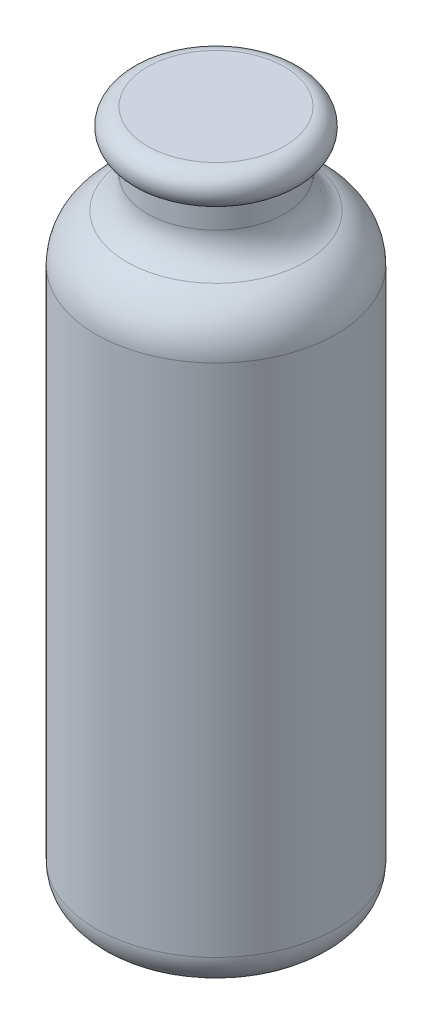
ISO-10303-21;
HEADER;
FILE_DESCRIPTION(('STEP AP214'),'2;1');
FILE_NAME('part.step','',(''),(''),'','','');
FILE_SCHEMA(('AUTOMOTIVE_DESIGN { 1 0 10303 214 1 1 1 1 }'));
ENDSEC;
DATA;
#1=APPLICATION_CONTEXT('core data for automotive mechanical design processes');
#2=APPLICATION_PROTOCOL_DEFINITION('international standard','automotive_design',2000,#1);
#3=PRODUCT_CONTEXT('',#1,'mechanical');
#4=PRODUCT('Part','Part','',(#3));
#5=PRODUCT_RELATED_PRODUCT_CATEGORY('part','',(#4));
#6=PRODUCT_DEFINITION_FORMATION('','',#4);
#7=PRODUCT_DEFINITION_CONTEXT('part definition',#1,'design');
#8=PRODUCT_DEFINITION('design','',#6,#7);
#9=PRODUCT_DEFINITION_SHAPE('','',#8);
#10=(LENGTH_UNIT() NAMED_UNIT(*) SI_UNIT(.MILLI.,.METRE.));
#11=(NAMED_UNIT(*) PLANE_ANGLE_UNIT() SI_UNIT($,.RADIAN.));
#12=(NAMED_UNIT(*) SI_UNIT($,.STERADIAN.) SOLID_ANGLE_UNIT());
#13=UNCERTAINTY_MEASURE_WITH_UNIT(LENGTH_MEASURE(1.E-05),#10,'distance_accuracy_value','');
#14=(GEOMETRIC_REPRESENTATION_CONTEXT(3) GLOBAL_UNCERTAINTY_ASSIGNED_CONTEXT((#13)) GLOBAL_UNIT_ASSIGNED_CONTEXT((#10,
#11,#12)) REPRESENTATION_CONTEXT('',''));
#15=CARTESIAN_POINT('',(0.,0.,0.));
#16=DIRECTION('',(0.,0.,1.));
#17=DIRECTION('',(1.,0.,0.));
#18=AXIS2_PLACEMENT_3D('',#15,#16,#17);
#19=CARTESIAN_POINT('',(0.,160.,0.));
#20=DIRECTION('',(0.,1.,0.));
#21=DIRECTION('',(0.,0.,1.));
#22=AXIS2_PLACEMENT_3D('',#19,#20,#21);
#23=TOROIDAL_SURFACE('',#22,20.,15.);
#24=CARTESIAN_POINT('',(0.,160.,0.));
#25=DIRECTION('',(0.,1.,0.));
#26=DIRECTION('',(0.,0.,1.));
#27=AXIS2_PLACEMENT_3D('',#24,#25,#26);
#28=CIRCLE('',#27,35.);
#29=CARTESIAN_POINT('',(0.,160.,35.));
#30=VERTEX_POINT('',#29);
#31=EDGE_CURVE('E90',#30,#30,#28,.T.);
#32=ORIENTED_EDGE('',*,*,#31,.T.);
#33=EDGE_LOOP('',(#32));
#34=FACE_BOUND('',#33,.T.);
#35=CARTESIAN_POINT('',(0.,173.747727084868,0.));
#36=DIRECTION('',(0.,1.,0.));
#37=DIRECTION('',(0.,0.,1.));
#38=AXIS2_PLACEMENT_3D('',#35,#36,#37);
#39=CIRCLE('',#38,26.);
#40=CARTESIAN_POINT('',(0.,173.747727084868,26.));
#41=VERTEX_POINT('',#40);
#42=EDGE_CURVE('E10',#41,#41,#39,.T.);
#43=ORIENTED_EDGE('',*,*,#42,.F.);
#44=EDGE_LOOP('',(#43));
#45=FACE_BOUND('',#44,.T.);
#46=ADVANCED_FACE('F40',(#34,#45),#23,.T.);
#47=CARTESIAN_POINT('',(0.,182.912878474779,0.));
#48=DIRECTION('',(0.,1.,0.));
#49=DIRECTION('',(0.,0.,1.));
#50=AXIS2_PLACEMENT_3D('',#47,#48,#49);
#51=TOROIDAL_SURFACE('',#50,30.,9.99999999999999);
#52=ORIENTED_EDGE('',*,*,#42,.T.);
#53=EDGE_LOOP('',(#52));
#54=FACE_BOUND('',#53,.T.);
#55=CARTESIAN_POINT('',(0.,182.912878474779,0.));
#56=DIRECTION('',(0.,1.,0.));
#57=DIRECTION('',(0.,0.,1.));
#58=AXIS2_PLACEMENT_3D('',#55,#56,#57);
#59=CIRCLE('',#58,20.);
#60=CARTESIAN_POINT('',(0.,182.912878474779,20.));
#61=VERTEX_POINT('',#60);
#62=EDGE_CURVE('E47',#61,#61,#59,.T.);
#63=ORIENTED_EDGE('',*,*,#62,.F.);
#64=EDGE_LOOP('',(#63));
#65=FACE_BOUND('',#64,.T.);
#66=ADVANCED_FACE('F109',(#54,#65),#51,.F.);
#67=CARTESIAN_POINT('',(0.,284.876693479873,0.));
#68=DIRECTION('',(0.,1.,0.));
#69=DIRECTION('',(0.,0.,1.));
#70=AXIS2_PLACEMENT_3D('',#67,#68,#69);
#71=CYLINDRICAL_SURFACE('',#70,20.);
#72=ORIENTED_EDGE('',*,*,#62,.T.);
#73=EDGE_LOOP('',(#72));
#74=FACE_BOUND('',#73,.T.);
#75=CARTESIAN_POINT('',(0.,190.,0.));
#76=DIRECTION('',(0.,1.,0.));
#77=DIRECTION('',(0.,0.,1.));
#78=AXIS2_PLACEMENT_3D('',#75,#76,#77);
#79=CIRCLE('',#78,20.);
#80=CARTESIAN_POINT('',(0.,190.,20.));
#81=VERTEX_POINT('',#80);
#82=EDGE_CURVE('E51',#81,#81,#79,.T.);
#83=ORIENTED_EDGE('',*,*,#82,.F.);
#84=EDGE_LOOP('',(#83));
#85=FACE_BOUND('',#84,.T.);
#86=ADVANCED_FACE('F113',(#74,#85),#71,.T.);
#87=CARTESIAN_POINT('',(0.,195.,0.));
#88=DIRECTION('',(0.,1.,0.));
#89=DIRECTION('',(0.,0.,1.));
#90=AXIS2_PLACEMENT_3D('',#87,#88,#89);
#91=TOROIDAL_SURFACE('',#90,20.,5.);
#92=ORIENTED_EDGE('',*,*,#82,.T.);
#93=EDGE_LOOP('',(#92));
#94=FACE_BOUND('',#93,.T.);
#95=CARTESIAN_POINT('',(0.,200.,0.));
#96=DIRECTION('',(0.,1.,0.));
#97=DIRECTION('',(0.,0.,1.));
#98=AXIS2_PLACEMENT_3D('',#95,#96,#97);
#99=CIRCLE('',#98,20.);
#100=CARTESIAN_POINT('',(0.,200.,20.));
#101=VERTEX_POINT('',#100);
#102=EDGE_CURVE('E55',#101,#101,#99,.T.);
#103=ORIENTED_EDGE('',*,*,#102,.F.);
#104=EDGE_LOOP('',(#103));
#105=FACE_BOUND('',#104,.T.);
#106=ADVANCED_FACE('F117',(#94,#105),#91,.T.);
#107=CARTESIAN_POINT('',(-20.,200.,0.));
#108=DIRECTION('',(0.,1.,0.));
#109=DIRECTION('',(0.,0.,1.));
#110=AXIS2_PLACEMENT_3D('',#107,#108,#109);
#111=PLANE('',#110);
#112=ORIENTED_EDGE('',*,*,#102,.T.);
#113=EDGE_LOOP('',(#112));
#114=FACE_BOUND('',#113,.T.);
#115=ADVANCED_FACE('F123',(#114),#111,.T.);
#116=CARTESIAN_POINT('',(-25.,0.,0.));
#117=DIRECTION('',(0.,-1.,0.));
#118=DIRECTION('',(0.,0.,-1.));
#119=AXIS2_PLACEMENT_3D('',#116,#117,#118);
#120=PLANE('',#119);
#121=CARTESIAN_POINT('',(0.,0.,0.));
#122=DIRECTION('',(0.,1.,0.));
#123=DIRECTION('',(0.,0.,1.));
#124=AXIS2_PLACEMENT_3D('',#121,#122,#123);
#125=CIRCLE('',#124,25.);
#126=CARTESIAN_POINT('',(0.,0.,25.));
#127=VERTEX_POINT('',#126);
#128=EDGE_CURVE('E84',#127,#127,#125,.T.);
#129=ORIENTED_EDGE('',*,*,#128,.F.);
#130=EDGE_LOOP('',(#129));
#131=FACE_BOUND('',#130,.T.);
#132=ADVANCED_FACE('F105',(#131),#120,.T.);
#133=CARTESIAN_POINT('',(0.,10.,0.));
#134=DIRECTION('',(0.,1.,0.));
#135=DIRECTION('',(0.,0.,1.));
#136=AXIS2_PLACEMENT_3D('',#133,#134,#135);
#137=TOROIDAL_SURFACE('',#136,25.,10.);
#138=ORIENTED_EDGE('',*,*,#128,.T.);
#139=EDGE_LOOP('',(#138));
#140=FACE_BOUND('',#139,.T.);
#141=CARTESIAN_POINT('',(0.,10.,0.));
#142=DIRECTION('',(0.,1.,0.));
#143=DIRECTION('',(0.,0.,1.));
#144=AXIS2_PLACEMENT_3D('',#141,#142,#143);
#145=CIRCLE('',#144,35.);
#146=CARTESIAN_POINT('',(0.,10.,35.));
#147=VERTEX_POINT('',#146);
#148=EDGE_CURVE('E87',#147,#147,#145,.T.);
#149=ORIENTED_EDGE('',*,*,#148,.F.);
#150=EDGE_LOOP('',(#149));
#151=FACE_BOUND('',#150,.T.);
#152=ADVANCED_FACE('F98',(#140,#151),#137,.T.);
#153=CARTESIAN_POINT('',(0.,284.876693479873,0.));
#154=DIRECTION('',(0.,1.,0.));
#155=DIRECTION('',(0.,0.,1.));
#156=AXIS2_PLACEMENT_3D('',#153,#154,#155);
#157=CYLINDRICAL_SURFACE('',#156,35.);
#158=ORIENTED_EDGE('',*,*,#148,.T.);
#159=EDGE_LOOP('',(#158));
#160=FACE_BOUND('',#159,.T.);
#161=ORIENTED_EDGE('',*,*,#31,.F.);
#162=EDGE_LOOP('',(#161));
#163=FACE_BOUND('',#162,.T.);
#164=ADVANCED_FACE('F96',(#160,#163),#157,.T.);
#165=CLOSED_SHELL('',(#46,#66,#86,#106,#115,#132,#152,#164));
#166=CARTESIAN_POINT('',(0.,199.,0.));
#167=DIRECTION('',(0.,-1.,0.));
#168=DIRECTION('',(0.,0.,-1.));
#169=AXIS2_PLACEMENT_3D('',#166,#167,#168);
#170=PLANE('',#169);
#171=CARTESIAN_POINT('',(0.,199.,0.));
#172=DIRECTION('',(0.,1.,0.));
#173=DIRECTION('',(0.,0.,1.));
#174=AXIS2_PLACEMENT_3D('',#171,#172,#173);
#175=CIRCLE('',#174,20.);
#176=CARTESIAN_POINT('',(0.,199.,20.));
#177=VERTEX_POINT('',#176);
#178=EDGE_CURVE('E60',#177,#177,#175,.T.);
#179=ORIENTED_EDGE('',*,*,#178,.F.);
#180=EDGE_LOOP('',(#179));
#181=FACE_BOUND('',#180,.T.);
#182=ADVANCED_FACE('F128',(#181),#170,.T.);
#183=CARTESIAN_POINT('',(0.,195.,0.));
#184=DIRECTION('',(0.,1.,0.));
#185=DIRECTION('',(0.,0.,1.));
#186=AXIS2_PLACEMENT_3D('',#183,#184,#185);
#187=TOROIDAL_SURFACE('',#186,20.,4.);
#188=ORIENTED_EDGE('',*,*,#178,.T.);
#189=EDGE_LOOP('',(#188));
#190=FACE_BOUND('',#189,.T.);
#191=CARTESIAN_POINT('',(0.,191.,0.));
#192=DIRECTION('',(0.,1.,0.));
#193=DIRECTION('',(0.,0.,1.));
#194=AXIS2_PLACEMENT_3D('',#191,#192,#193);
#195=CIRCLE('',#194,20.);
#196=CARTESIAN_POINT('',(0.,191.,20.));
#197=VERTEX_POINT('',#196);
#198=EDGE_CURVE('E63',#197,#197,#195,.T.);
#199=ORIENTED_EDGE('',*,*,#198,.F.);
#200=EDGE_LOOP('',(#199));
#201=FACE_BOUND('',#200,.T.);
#202=ADVANCED_FACE('F130',(#190,#201),#187,.F.);
#203=CARTESIAN_POINT('',(-20.,191.,0.));
#204=DIRECTION('',(0.,1.,0.));
#205=DIRECTION('',(0.,0.,1.));
#206=AXIS2_PLACEMENT_3D('',#203,#204,#205);
#207=PLANE('',#206);
#208=ORIENTED_EDGE('',*,*,#198,.T.);
#209=EDGE_LOOP('',(#208));
#210=FACE_BOUND('',#209,.T.);
#211=CARTESIAN_POINT('',(0.,191.,0.));
#212=DIRECTION('',(0.,1.,0.));
#213=DIRECTION('',(0.,0.,1.));
#214=AXIS2_PLACEMENT_3D('',#211,#212,#213);
#215=CIRCLE('',#214,19.);
#216=CARTESIAN_POINT('',(0.,191.,19.));
#217=VERTEX_POINT('',#216);
#218=EDGE_CURVE('E66',#217,#217,#215,.T.);
#219=ORIENTED_EDGE('',*,*,#218,.F.);
#220=EDGE_LOOP('',(#219));
#221=FACE_BOUND('',#220,.T.);
#222=ADVANCED_FACE('F135',(#210,#221),#207,.T.);
#223=CARTESIAN_POINT('',(0.,284.876693479873,0.));
#224=DIRECTION('',(0.,1.,0.));
#225=DIRECTION('',(0.,0.,1.));
#226=AXIS2_PLACEMENT_3D('',#223,#224,#225);
#227=CYLINDRICAL_SURFACE('',#226,19.);
#228=ORIENTED_EDGE('',*,*,#218,.T.);
#229=EDGE_LOOP('',(#228));
#230=FACE_BOUND('',#229,.T.);
#231=CARTESIAN_POINT('',(0.,182.912878474779,0.));
#232=DIRECTION('',(0.,1.,0.));
#233=DIRECTION('',(0.,0.,1.));
#234=AXIS2_PLACEMENT_3D('',#231,#232,#233);
#235=CIRCLE('',#234,19.);
#236=CARTESIAN_POINT('',(0.,182.912878474779,19.));
#237=VERTEX_POINT('',#236);
#238=EDGE_CURVE('E69',#237,#237,#235,.T.);
#239=ORIENTED_EDGE('',*,*,#238,.F.);
#240=EDGE_LOOP('',(#239));
#241=FACE_BOUND('',#240,.T.);
#242=ADVANCED_FACE('F139',(#230,#241),#227,.F.);
#243=CARTESIAN_POINT('',(0.,182.912878474779,0.));
#244=DIRECTION('',(0.,1.,0.));
#245=DIRECTION('',(0.,0.,1.));
#246=AXIS2_PLACEMENT_3D('',#243,#244,#245);
#247=TOROIDAL_SURFACE('',#246,30.,11.);
#248=ORIENTED_EDGE('',*,*,#238,.T.);
#249=EDGE_LOOP('',(#248));
#250=FACE_BOUND('',#249,.T.);
#251=CARTESIAN_POINT('',(0.,172.831211945876,0.));
#252=DIRECTION('',(0.,1.,0.));
#253=DIRECTION('',(0.,0.,1.));
#254=AXIS2_PLACEMENT_3D('',#251,#252,#253);
#255=CIRCLE('',#254,25.6);
#256=CARTESIAN_POINT('',(0.,172.831211945876,25.6));
#257=VERTEX_POINT('',#256);
#258=EDGE_CURVE('E72',#257,#257,#255,.T.);
#259=ORIENTED_EDGE('',*,*,#258,.F.);
#260=EDGE_LOOP('',(#259));
#261=FACE_BOUND('',#260,.T.);
#262=ADVANCED_FACE('F143',(#250,#261),#247,.T.);
#263=CARTESIAN_POINT('',(0.,160.,0.));
#264=DIRECTION('',(0.,1.,0.));
#265=DIRECTION('',(0.,0.,1.));
#266=AXIS2_PLACEMENT_3D('',#263,#264,#265);
#267=TOROIDAL_SURFACE('',#266,20.,14.);
#268=ORIENTED_EDGE('',*,*,#258,.T.);
#269=EDGE_LOOP('',(#268));
#270=FACE_BOUND('',#269,.T.);
#271=CARTESIAN_POINT('',(0.,160.,0.));
#272=DIRECTION('',(0.,1.,0.));
#273=DIRECTION('',(0.,0.,1.));
#274=AXIS2_PLACEMENT_3D('',#271,#272,#273);
#275=CIRCLE('',#274,34.);
#276=CARTESIAN_POINT('',(0.,160.,34.));
#277=VERTEX_POINT('',#276);
#278=EDGE_CURVE('E75',#277,#277,#275,.T.);
#279=ORIENTED_EDGE('',*,*,#278,.F.);
#280=EDGE_LOOP('',(#279));
#281=FACE_BOUND('',#280,.T.);
#282=ADVANCED_FACE('F147',(#270,#281),#267,.F.);
#283=CARTESIAN_POINT('',(0.,284.876693479873,0.));
#284=DIRECTION('',(0.,1.,0.));
#285=DIRECTION('',(0.,0.,1.));
#286=AXIS2_PLACEMENT_3D('',#283,#284,#285);
#287=CYLINDRICAL_SURFACE('',#286,34.);
#288=ORIENTED_EDGE('',*,*,#278,.T.);
#289=EDGE_LOOP('',(#288));
#290=FACE_BOUND('',#289,.T.);
#291=CARTESIAN_POINT('',(0.,10.,0.));
#292=DIRECTION('',(0.,1.,0.));
#293=DIRECTION('',(0.,0.,1.));
#294=AXIS2_PLACEMENT_3D('',#291,#292,#293);
#295=CIRCLE('',#294,34.);
#296=CARTESIAN_POINT('',(0.,10.,34.));
#297=VERTEX_POINT('',#296);
#298=EDGE_CURVE('E78',#297,#297,#295,.T.);
#299=ORIENTED_EDGE('',*,*,#298,.F.);
#300=EDGE_LOOP('',(#299));
#301=FACE_BOUND('',#300,.T.);
#302=ADVANCED_FACE('F151',(#290,#301),#287,.F.);
#303=CARTESIAN_POINT('',(0.,10.,0.));
#304=DIRECTION('',(0.,1.,0.));
#305=DIRECTION('',(0.,0.,1.));
#306=AXIS2_PLACEMENT_3D('',#303,#304,#305);
#307=TOROIDAL_SURFACE('',#306,25.,9.);
#308=ORIENTED_EDGE('',*,*,#298,.T.);
#309=EDGE_LOOP('',(#308));
#310=FACE_BOUND('',#309,.T.);
#311=CARTESIAN_POINT('',(0.,1.,0.));
#312=DIRECTION('',(0.,1.,0.));
#313=DIRECTION('',(0.,0.,1.));
#314=AXIS2_PLACEMENT_3D('',#311,#312,#313);
#315=CIRCLE('',#314,25.);
#316=CARTESIAN_POINT('',(0.,1.,25.));
#317=VERTEX_POINT('',#316);
#318=EDGE_CURVE('E81',#317,#317,#315,.T.);
#319=ORIENTED_EDGE('',*,*,#318,.F.);
#320=EDGE_LOOP('',(#319));
#321=FACE_BOUND('',#320,.T.);
#322=ADVANCED_FACE('F155',(#310,#321),#307,.F.);
#323=CARTESIAN_POINT('',(-25.,1.,0.));
#324=DIRECTION('',(0.,1.,0.));
#325=DIRECTION('',(0.,0.,1.));
#326=AXIS2_PLACEMENT_3D('',#323,#324,#325);
#327=PLANE('',#326);
#328=ORIENTED_EDGE('',*,*,#318,.T.);
#329=EDGE_LOOP('',(#328));
#330=FACE_BOUND('',#329,.T.);
#331=ADVANCED_FACE('F159',(#330),#327,.T.);
#332=CLOSED_SHELL('',(#182,#202,#222,#242,#262,#282,#302,#322,#331));
#333=ORIENTED_CLOSED_SHELL('',*,#332,.T.);
#334=BREP_WITH_VOIDS('B2',#165,(#333));
#335=ADVANCED_BREP_SHAPE_REPRESENTATION('',(#18,#334),#14);
#336=SHAPE_DEFINITION_REPRESENTATION(#9,#335);
ENDSEC;
END-ISO-10303-21;
